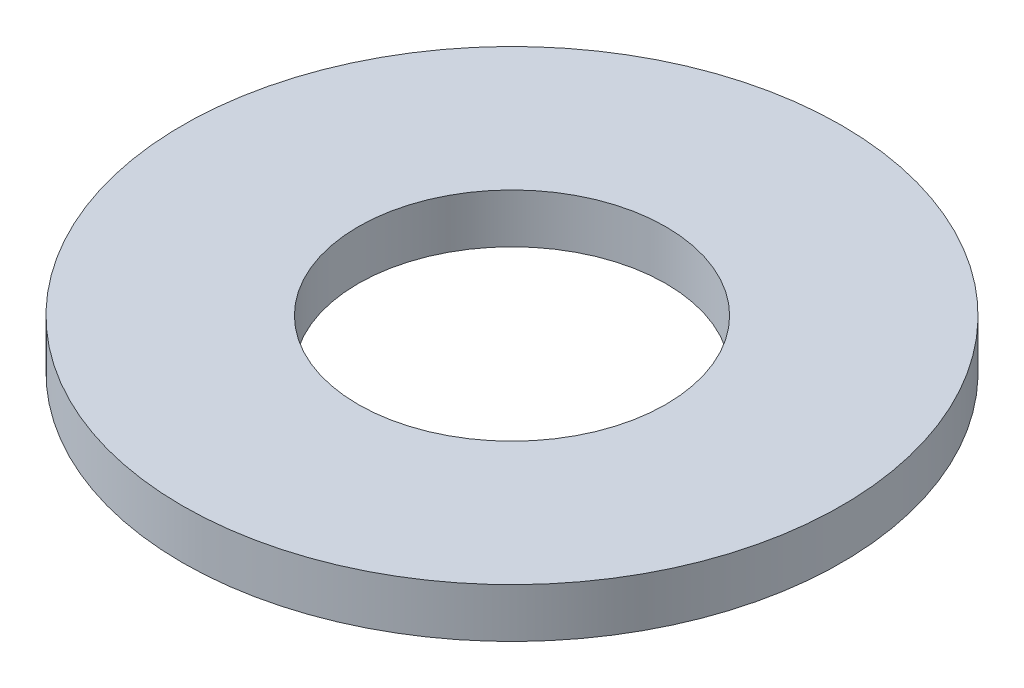
ISO-10303-21;
HEADER;
FILE_DESCRIPTION(('STEP AP214'),'2;1');
FILE_NAME('part.step','',(''),(''),'','','');
FILE_SCHEMA(('AUTOMOTIVE_DESIGN { 1 0 10303 214 1 1 1 1 }'));
ENDSEC;
DATA;
#1=APPLICATION_CONTEXT('core data for automotive mechanical design processes');
#2=APPLICATION_PROTOCOL_DEFINITION('international standard','automotive_design',2000,#1);
#3=PRODUCT_CONTEXT('',#1,'mechanical');
#4=PRODUCT('Part','Part','',(#3));
#5=PRODUCT_RELATED_PRODUCT_CATEGORY('part','',(#4));
#6=PRODUCT_DEFINITION_FORMATION('','',#4);
#7=PRODUCT_DEFINITION_CONTEXT('part definition',#1,'design');
#8=PRODUCT_DEFINITION('design','',#6,#7);
#9=PRODUCT_DEFINITION_SHAPE('','',#8);
#10=(LENGTH_UNIT() NAMED_UNIT(*) SI_UNIT(.MILLI.,.METRE.));
#11=(NAMED_UNIT(*) PLANE_ANGLE_UNIT() SI_UNIT($,.RADIAN.));
#12=(NAMED_UNIT(*) SI_UNIT($,.STERADIAN.) SOLID_ANGLE_UNIT());
#13=UNCERTAINTY_MEASURE_WITH_UNIT(LENGTH_MEASURE(1.E-05),#10,'distance_accuracy_value','');
#14=(GEOMETRIC_REPRESENTATION_CONTEXT(3) GLOBAL_UNCERTAINTY_ASSIGNED_CONTEXT((#13)) GLOBAL_UNIT_ASSIGNED_CONTEXT((#10,
#11,#12)) REPRESENTATION_CONTEXT('',''));
#15=CARTESIAN_POINT('',(0.,0.,0.));
#16=DIRECTION('',(0.,0.,1.));
#17=DIRECTION('',(1.,0.,0.));
#18=AXIS2_PLACEMENT_3D('',#15,#16,#17);
#19=CARTESIAN_POINT('',(0.,0.52,0.));
#20=DIRECTION('',(0.,1.,0.));
#21=DIRECTION('',(0.,0.,1.));
#22=AXIS2_PLACEMENT_3D('',#19,#20,#21);
#23=PLANE('',#22);
#24=CARTESIAN_POINT('',(0.,0.52,0.));
#25=DIRECTION('',(0.,1.,0.));
#26=DIRECTION('',(0.,0.,1.));
#27=AXIS2_PLACEMENT_3D('',#24,#25,#26);
#28=CIRCLE('',#27,3.48);
#29=CARTESIAN_POINT('',(0.,0.52,3.48));
#30=VERTEX_POINT('',#29);
#31=EDGE_CURVE('E10',#30,#30,#28,.T.);
#32=ORIENTED_EDGE('',*,*,#31,.T.);
#33=EDGE_LOOP('',(#32));
#34=FACE_BOUND('',#33,.T.);
#35=CARTESIAN_POINT('',(0.,0.52,0.));
#36=DIRECTION('',(0.,1.,0.));
#37=DIRECTION('',(0.,0.,1.));
#38=AXIS2_PLACEMENT_3D('',#35,#36,#37);
#39=CIRCLE('',#38,1.625);
#40=CARTESIAN_POINT('',(0.,0.52,1.625));
#41=VERTEX_POINT('',#40);
#42=EDGE_CURVE('E50',#41,#41,#39,.T.);
#43=ORIENTED_EDGE('',*,*,#42,.F.);
#44=EDGE_LOOP('',(#43));
#45=FACE_BOUND('',#44,.T.);
#46=ADVANCED_FACE('F37',(#34,#45),#23,.T.);
#47=CARTESIAN_POINT('',(0.,0.,0.));
#48=DIRECTION('',(0.,1.,0.));
#49=DIRECTION('',(0.,0.,1.));
#50=AXIS2_PLACEMENT_3D('',#47,#48,#49);
#51=PLANE('',#50);
#52=CARTESIAN_POINT('',(0.,0.,0.));
#53=DIRECTION('',(0.,1.,0.));
#54=DIRECTION('',(0.,0.,1.));
#55=AXIS2_PLACEMENT_3D('',#52,#53,#54);
#56=CIRCLE('',#55,3.48);
#57=CARTESIAN_POINT('',(0.,0.,3.48));
#58=VERTEX_POINT('',#57);
#59=EDGE_CURVE('E41',#58,#58,#56,.T.);
#60=ORIENTED_EDGE('',*,*,#59,.F.);
#61=EDGE_LOOP('',(#60));
#62=FACE_BOUND('',#61,.T.);
#63=CARTESIAN_POINT('',(0.,0.,0.));
#64=DIRECTION('',(0.,1.,0.));
#65=DIRECTION('',(0.,0.,1.));
#66=AXIS2_PLACEMENT_3D('',#63,#64,#65);
#67=CIRCLE('',#66,1.625);
#68=CARTESIAN_POINT('',(0.,0.,1.625));
#69=VERTEX_POINT('',#68);
#70=EDGE_CURVE('E52',#69,#69,#67,.T.);
#71=ORIENTED_EDGE('',*,*,#70,.T.);
#72=EDGE_LOOP('',(#71));
#73=FACE_BOUND('',#72,.T.);
#74=ADVANCED_FACE('F64',(#62,#73),#51,.F.);
#75=CARTESIAN_POINT('',(0.,0.52,0.));
#76=DIRECTION('',(0.,-1.,0.));
#77=DIRECTION('',(0.,0.,-1.));
#78=AXIS2_PLACEMENT_3D('',#75,#76,#77);
#79=CYLINDRICAL_SURFACE('',#78,3.48);
#80=ORIENTED_EDGE('',*,*,#31,.F.);
#81=EDGE_LOOP('',(#80));
#82=FACE_BOUND('',#81,.T.);
#83=ORIENTED_EDGE('',*,*,#59,.T.);
#84=EDGE_LOOP('',(#83));
#85=FACE_BOUND('',#84,.T.);
#86=ADVANCED_FACE('F39',(#82,#85),#79,.T.);
#87=CARTESIAN_POINT('',(0.,0.52,0.));
#88=DIRECTION('',(0.,-1.,0.));
#89=DIRECTION('',(0.,0.,-1.));
#90=AXIS2_PLACEMENT_3D('',#87,#88,#89);
#91=CYLINDRICAL_SURFACE('',#90,1.625);
#92=ORIENTED_EDGE('',*,*,#42,.T.);
#93=EDGE_LOOP('',(#92));
#94=FACE_BOUND('',#93,.T.);
#95=ORIENTED_EDGE('',*,*,#70,.F.);
#96=EDGE_LOOP('',(#95));
#97=FACE_BOUND('',#96,.T.);
#98=ADVANCED_FACE('F60',(#94,#97),#91,.F.);
#99=CLOSED_SHELL('',(#46,#74,#86,#98));
#100=MANIFOLD_SOLID_BREP('B2',#99);
#101=ADVANCED_BREP_SHAPE_REPRESENTATION('',(#18,#100),#14);
#102=SHAPE_DEFINITION_REPRESENTATION(#9,#101);
ENDSEC;
END-ISO-10303-21;
